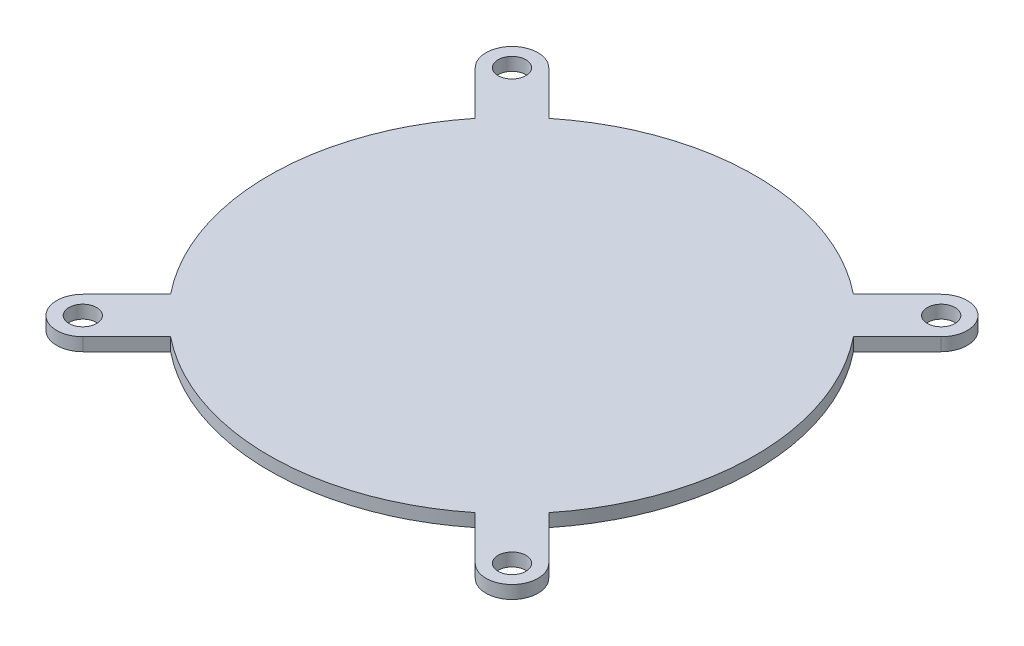
ISO-10303-21;
HEADER;
FILE_DESCRIPTION(('STEP AP214'),'2;1');
FILE_NAME('part.step','',(''),(''),'','','');
FILE_SCHEMA(('AUTOMOTIVE_DESIGN { 1 0 10303 214 1 1 1 1 }'));
ENDSEC;
DATA;
#1=APPLICATION_CONTEXT('core data for automotive mechanical design processes');
#2=APPLICATION_PROTOCOL_DEFINITION('international standard','automotive_design',2000,#1);
#3=PRODUCT_CONTEXT('',#1,'mechanical');
#4=PRODUCT('Part','Part','',(#3));
#5=PRODUCT_RELATED_PRODUCT_CATEGORY('part','',(#4));
#6=PRODUCT_DEFINITION_FORMATION('','',#4);
#7=PRODUCT_DEFINITION_CONTEXT('part definition',#1,'design');
#8=PRODUCT_DEFINITION('design','',#6,#7);
#9=PRODUCT_DEFINITION_SHAPE('','',#8);
#10=(LENGTH_UNIT() NAMED_UNIT(*) SI_UNIT(.MILLI.,.METRE.));
#11=(NAMED_UNIT(*) PLANE_ANGLE_UNIT() SI_UNIT($,.RADIAN.));
#12=(NAMED_UNIT(*) SI_UNIT($,.STERADIAN.) SOLID_ANGLE_UNIT());
#13=UNCERTAINTY_MEASURE_WITH_UNIT(LENGTH_MEASURE(1.E-05),#10,'distance_accuracy_value','');
#14=(GEOMETRIC_REPRESENTATION_CONTEXT(3) GLOBAL_UNCERTAINTY_ASSIGNED_CONTEXT((#13)) GLOBAL_UNIT_ASSIGNED_CONTEXT((#10,
#11,#12)) REPRESENTATION_CONTEXT('',''));
#15=CARTESIAN_POINT('',(0.,0.,0.));
#16=DIRECTION('',(0.,0.,1.));
#17=DIRECTION('',(1.,0.,0.));
#18=AXIS2_PLACEMENT_3D('',#15,#16,#17);
#19=CARTESIAN_POINT('',(0.,-8.,0.));
#20=DIRECTION('',(0.,1.,0.));
#21=DIRECTION('',(0.,0.,1.));
#22=AXIS2_PLACEMENT_3D('',#19,#20,#21);
#23=CYLINDRICAL_SURFACE('',#22,13.8);
#24=CARTESIAN_POINT('',(0.,0.,0.));
#25=DIRECTION('',(0.,1.,0.));
#26=DIRECTION('',(0.,0.,1.));
#27=AXIS2_PLACEMENT_3D('',#24,#25,#26);
#28=CIRCLE('',#27,13.8);
#29=CARTESIAN_POINT('',(0.,0.,13.8));
#30=VERTEX_POINT('',#29);
#31=EDGE_CURVE('E41',#30,#30,#28,.F.);
#32=ORIENTED_EDGE('',*,*,#31,.T.);
#33=EDGE_LOOP('',(#32));
#34=FACE_BOUND('',#33,.T.);
#35=CARTESIAN_POINT('',(0.,-9.,0.));
#36=DIRECTION('',(0.,-1.,0.));
#37=DIRECTION('',(0.,0.,-1.));
#38=AXIS2_PLACEMENT_3D('',#35,#36,#37);
#39=CIRCLE('',#38,13.8);
#40=CARTESIAN_POINT('',(0.,-9.,-13.8));
#41=VERTEX_POINT('',#40);
#42=EDGE_CURVE('E152',#41,#41,#39,.T.);
#43=ORIENTED_EDGE('',*,*,#42,.F.);
#44=EDGE_LOOP('',(#43));
#45=FACE_BOUND('',#44,.T.);
#46=ADVANCED_FACE('F32',(#34,#45),#23,.T.);
#47=CARTESIAN_POINT('',(-21.2132034355964,1.5,21.2132034355964));
#48=DIRECTION('',(0.,1.,0.));
#49=DIRECTION('',(0.,0.,1.));
#50=AXIS2_PLACEMENT_3D('',#47,#48,#49);
#51=PLANE('',#50);
#52=DIRECTION('',(0.707106781186544,0.,-0.707106781186551));
#53=VECTOR('',#52,1.);
#54=CARTESIAN_POINT('',(-19.0918830920368,1.5,23.3345237791561));
#55=LINE('',#54,#53);
#56=CARTESIAN_POINT('',(-22.6274169979695,1.5,26.8700576850888));
#57=VERTEX_POINT('',#56);
#58=CARTESIAN_POINT('',(-17.5636993414699,1.5,21.8063400285892));
#59=VERTEX_POINT('',#58);
#60=EDGE_CURVE('E196',#57,#59,#55,.T.);
#61=ORIENTED_EDGE('',*,*,#60,.T.);
#62=CARTESIAN_POINT('',(0.,1.5,0.));
#63=DIRECTION('',(0.,1.,0.));
#64=DIRECTION('',(0.,0.,1.));
#65=AXIS2_PLACEMENT_3D('',#62,#63,#64);
#66=CIRCLE('',#65,28.);
#67=CARTESIAN_POINT('',(17.5636993414699,1.5,21.8063400285892));
#68=VERTEX_POINT('',#67);
#69=EDGE_CURVE('E148',#59,#68,#66,.T.);
#70=ORIENTED_EDGE('',*,*,#69,.T.);
#71=DIRECTION('',(0.70710678118655,0.,0.707106781186545));
#72=VECTOR('',#71,1.);
#73=CARTESIAN_POINT('',(19.0918830920368,1.5,23.3345237791561));
#74=LINE('',#73,#72);
#75=CARTESIAN_POINT('',(22.6274169979695,1.5,26.8700576850888));
#76=VERTEX_POINT('',#75);
#77=EDGE_CURVE('E274',#68,#76,#74,.T.);
#78=ORIENTED_EDGE('',*,*,#77,.T.);
#79=CARTESIAN_POINT('',(24.7487373415292,1.5,24.7487373415292));
#80=DIRECTION('',(0.,1.,0.));
#81=DIRECTION('',(0.,0.,1.));
#82=AXIS2_PLACEMENT_3D('',#79,#80,#81);
#83=CIRCLE('',#82,3.);
#84=CARTESIAN_POINT('',(26.8700576850888,1.5,22.6274169979695));
#85=VERTEX_POINT('',#84);
#86=EDGE_CURVE('E230',#76,#85,#83,.T.);
#87=ORIENTED_EDGE('',*,*,#86,.T.);
#88=DIRECTION('',(-0.707106781186548,0.,-0.707106781186547));
#89=VECTOR('',#88,1.);
#90=CARTESIAN_POINT('',(23.3345237791561,1.5,19.0918830920368));
#91=LINE('',#90,#89);
#92=CARTESIAN_POINT('',(21.8063400285892,1.5,17.5636993414699));
#93=VERTEX_POINT('',#92);
#94=EDGE_CURVE('E276',#85,#93,#91,.T.);
#95=ORIENTED_EDGE('',*,*,#94,.T.);
#96=CARTESIAN_POINT('',(21.8063400285892,1.5,-17.5636993414699));
#97=VERTEX_POINT('',#96);
#98=EDGE_CURVE('E166',#93,#97,#66,.T.);
#99=ORIENTED_EDGE('',*,*,#98,.T.);
#100=DIRECTION('',(0.707106781186547,0.,-0.707106781186548));
#101=VECTOR('',#100,1.);
#102=CARTESIAN_POINT('',(23.3345237791561,1.5,-19.0918830920368));
#103=LINE('',#102,#101);
#104=CARTESIAN_POINT('',(26.8700576850888,1.5,-22.6274169979695));
#105=VERTEX_POINT('',#104);
#106=EDGE_CURVE('E279',#97,#105,#103,.T.);
#107=ORIENTED_EDGE('',*,*,#106,.T.);
#108=CARTESIAN_POINT('',(24.7487373415292,1.5,-24.7487373415292));
#109=DIRECTION('',(0.,1.,0.));
#110=DIRECTION('',(0.,0.,-1.));
#111=AXIS2_PLACEMENT_3D('',#108,#109,#110);
#112=CIRCLE('',#111,3.);
#113=CARTESIAN_POINT('',(22.6274169979695,1.5,-26.8700576850888));
#114=VERTEX_POINT('',#113);
#115=EDGE_CURVE('E248',#105,#114,#112,.T.);
#116=ORIENTED_EDGE('',*,*,#115,.T.);
#117=DIRECTION('',(-0.707106781186544,0.,0.707106781186551));
#118=VECTOR('',#117,1.);
#119=CARTESIAN_POINT('',(19.0918830920368,1.5,-23.3345237791561));
#120=LINE('',#119,#118);
#121=CARTESIAN_POINT('',(17.5636993414699,1.5,-21.8063400285892));
#122=VERTEX_POINT('',#121);
#123=EDGE_CURVE('E281',#114,#122,#120,.T.);
#124=ORIENTED_EDGE('',*,*,#123,.T.);
#125=CARTESIAN_POINT('',(-17.5636993414699,1.5,-21.8063400285892));
#126=VERTEX_POINT('',#125);
#127=EDGE_CURVE('E314',#122,#126,#66,.T.);
#128=ORIENTED_EDGE('',*,*,#127,.T.);
#129=DIRECTION('',(-0.707106781186551,0.,-0.707106781186544));
#130=VECTOR('',#129,1.);
#131=CARTESIAN_POINT('',(-19.0918830920368,1.5,-23.3345237791561));
#132=LINE('',#131,#130);
#133=CARTESIAN_POINT('',(-22.6274169979695,1.5,-26.8700576850888));
#134=VERTEX_POINT('',#133);
#135=EDGE_CURVE('E284',#126,#134,#132,.T.);
#136=ORIENTED_EDGE('',*,*,#135,.T.);
#137=CARTESIAN_POINT('',(-24.7487373415292,1.5,-24.7487373415292));
#138=DIRECTION('',(0.,1.,0.));
#139=DIRECTION('',(0.,0.,1.));
#140=AXIS2_PLACEMENT_3D('',#137,#138,#139);
#141=CIRCLE('',#140,3.);
#142=CARTESIAN_POINT('',(-26.8700576850888,1.5,-22.6274169979695));
#143=VERTEX_POINT('',#142);
#144=EDGE_CURVE('E264',#134,#143,#141,.T.);
#145=ORIENTED_EDGE('',*,*,#144,.T.);
#146=DIRECTION('',(0.707106781186552,0.,0.707106781186543));
#147=VECTOR('',#146,1.);
#148=CARTESIAN_POINT('',(-23.3345237791561,1.5,-19.0918830920368));
#149=LINE('',#148,#147);
#150=CARTESIAN_POINT('',(-21.8063400285892,1.5,-17.5636993414699));
#151=VERTEX_POINT('',#150);
#152=EDGE_CURVE('E285',#143,#151,#149,.T.);
#153=ORIENTED_EDGE('',*,*,#152,.T.);
#154=CARTESIAN_POINT('',(-21.8063400285892,1.5,17.5636993414699));
#155=VERTEX_POINT('',#154);
#156=EDGE_CURVE('E293',#151,#155,#66,.T.);
#157=ORIENTED_EDGE('',*,*,#156,.T.);
#158=DIRECTION('',(-0.707106781186543,0.,0.707106781186552));
#159=VECTOR('',#158,1.);
#160=CARTESIAN_POINT('',(-23.3345237791561,1.5,19.0918830920368));
#161=LINE('',#160,#159);
#162=CARTESIAN_POINT('',(-26.8700576850888,1.5,22.6274169979695));
#163=VERTEX_POINT('',#162);
#164=EDGE_CURVE('E180',#155,#163,#161,.T.);
#165=ORIENTED_EDGE('',*,*,#164,.T.);
#166=CARTESIAN_POINT('',(-24.7487373415292,1.5,24.7487373415292));
#167=DIRECTION('',(0.,1.,0.));
#168=DIRECTION('',(0.,0.,-1.));
#169=AXIS2_PLACEMENT_3D('',#166,#167,#168);
#170=CIRCLE('',#169,3.);
#171=EDGE_CURVE('E204',#163,#57,#170,.T.);
#172=ORIENTED_EDGE('',*,*,#171,.T.);
#173=EDGE_LOOP('',(#61,#70,#78,#87,#95,#99,#107,#116,#124,#128,#136,#145,#153,#157,#165,#172));
#174=FACE_BOUND('',#173,.T.);
#175=CARTESIAN_POINT('',(-24.7487373415292,1.5,24.7487373415292));
#176=DIRECTION('',(0.,1.,0.));
#177=DIRECTION('',(0.,0.,-1.));
#178=AXIS2_PLACEMENT_3D('',#175,#176,#177);
#179=CIRCLE('',#178,1.6);
#180=CARTESIAN_POINT('',(-24.7487373415292,1.5,23.1487373415292));
#181=VERTEX_POINT('',#180);
#182=EDGE_CURVE('E200',#181,#181,#179,.T.);
#183=ORIENTED_EDGE('',*,*,#182,.F.);
#184=EDGE_LOOP('',(#183));
#185=FACE_BOUND('',#184,.T.);
#186=CARTESIAN_POINT('',(-24.7487373415292,1.5,-24.7487373415292));
#187=DIRECTION('',(0.,1.,0.));
#188=DIRECTION('',(0.,0.,1.));
#189=AXIS2_PLACEMENT_3D('',#186,#187,#188);
#190=CIRCLE('',#189,1.6);
#191=CARTESIAN_POINT('',(-24.7487373415292,1.5,-23.1487373415292));
#192=VERTEX_POINT('',#191);
#193=EDGE_CURVE('E258',#192,#192,#190,.T.);
#194=ORIENTED_EDGE('',*,*,#193,.F.);
#195=EDGE_LOOP('',(#194));
#196=FACE_BOUND('',#195,.T.);
#197=CARTESIAN_POINT('',(24.7487373415292,1.5,-24.7487373415292));
#198=DIRECTION('',(0.,1.,0.));
#199=DIRECTION('',(0.,0.,-1.));
#200=AXIS2_PLACEMENT_3D('',#197,#198,#199);
#201=CIRCLE('',#200,1.6);
#202=CARTESIAN_POINT('',(24.7487373415292,1.5,-26.3487373415292));
#203=VERTEX_POINT('',#202);
#204=EDGE_CURVE('E240',#203,#203,#201,.T.);
#205=ORIENTED_EDGE('',*,*,#204,.F.);
#206=EDGE_LOOP('',(#205));
#207=FACE_BOUND('',#206,.T.);
#208=CARTESIAN_POINT('',(24.7487373415292,1.5,24.7487373415292));
#209=DIRECTION('',(0.,1.,0.));
#210=DIRECTION('',(0.,0.,1.));
#211=AXIS2_PLACEMENT_3D('',#208,#209,#210);
#212=CIRCLE('',#211,1.6);
#213=CARTESIAN_POINT('',(24.7487373415292,1.5,26.3487373415292));
#214=VERTEX_POINT('',#213);
#215=EDGE_CURVE('E223',#214,#214,#212,.T.);
#216=ORIENTED_EDGE('',*,*,#215,.F.);
#217=EDGE_LOOP('',(#216));
#218=FACE_BOUND('',#217,.T.);
#219=ADVANCED_FACE('F290',(#174,#185,#196,#207,#218),#51,.T.);
#220=CARTESIAN_POINT('',(-21.2132034355964,0.,21.2132034355964));
#221=DIRECTION('',(0.,1.,0.));
#222=DIRECTION('',(0.,0.,1.));
#223=AXIS2_PLACEMENT_3D('',#220,#221,#222);
#224=PLANE('',#223);
#225=DIRECTION('',(-0.707106781186543,0.,0.707106781186552));
#226=VECTOR('',#225,1.);
#227=CARTESIAN_POINT('',(-23.3345237791561,0.,19.0918830920368));
#228=LINE('',#227,#226);
#229=CARTESIAN_POINT('',(-21.8063400285892,0.,17.5636993414699));
#230=VERTEX_POINT('',#229);
#231=CARTESIAN_POINT('',(-26.8700576850888,0.,22.6274169979695));
#232=VERTEX_POINT('',#231);
#233=EDGE_CURVE('E194',#230,#232,#228,.T.);
#234=ORIENTED_EDGE('',*,*,#233,.F.);
#235=CARTESIAN_POINT('',(0.,0.,0.));
#236=DIRECTION('',(0.,1.,0.));
#237=DIRECTION('',(0.,0.,1.));
#238=AXIS2_PLACEMENT_3D('',#235,#236,#237);
#239=CIRCLE('',#238,28.);
#240=CARTESIAN_POINT('',(-21.8063400285892,0.,-17.5636993414699));
#241=VERTEX_POINT('',#240);
#242=EDGE_CURVE('E168',#230,#241,#239,.F.);
#243=ORIENTED_EDGE('',*,*,#242,.T.);
#244=DIRECTION('',(0.707106781186552,0.,0.707106781186543));
#245=VECTOR('',#244,1.);
#246=CARTESIAN_POINT('',(-23.3345237791561,0.,-19.0918830920368));
#247=LINE('',#246,#245);
#248=CARTESIAN_POINT('',(-26.8700576850888,0.,-22.6274169979695));
#249=VERTEX_POINT('',#248);
#250=EDGE_CURVE('E191',#249,#241,#247,.T.);
#251=ORIENTED_EDGE('',*,*,#250,.F.);
#252=CARTESIAN_POINT('',(-24.7487373415292,0.,-24.7487373415292));
#253=DIRECTION('',(0.,1.,0.));
#254=DIRECTION('',(0.,0.,1.));
#255=AXIS2_PLACEMENT_3D('',#252,#253,#254);
#256=CIRCLE('',#255,3.);
#257=CARTESIAN_POINT('',(-22.6274169979695,0.,-26.8700576850888));
#258=VERTEX_POINT('',#257);
#259=EDGE_CURVE('E259',#249,#258,#256,.F.);
#260=ORIENTED_EDGE('',*,*,#259,.T.);
#261=DIRECTION('',(-0.707106781186551,0.,-0.707106781186544));
#262=VECTOR('',#261,1.);
#263=CARTESIAN_POINT('',(-19.0918830920368,0.,-23.3345237791561));
#264=LINE('',#263,#262);
#265=CARTESIAN_POINT('',(-17.5636993414699,0.,-21.8063400285892));
#266=VERTEX_POINT('',#265);
#267=EDGE_CURVE('E47',#266,#258,#264,.T.);
#268=ORIENTED_EDGE('',*,*,#267,.F.);
#269=CARTESIAN_POINT('',(17.5636993414699,0.,-21.8063400285892));
#270=VERTEX_POINT('',#269);
#271=EDGE_CURVE('E303',#266,#270,#239,.F.);
#272=ORIENTED_EDGE('',*,*,#271,.T.);
#273=DIRECTION('',(-0.707106781186544,0.,0.707106781186551));
#274=VECTOR('',#273,1.);
#275=CARTESIAN_POINT('',(19.0918830920368,0.,-23.3345237791561));
#276=LINE('',#275,#274);
#277=CARTESIAN_POINT('',(22.6274169979695,0.,-26.8700576850888));
#278=VERTEX_POINT('',#277);
#279=EDGE_CURVE('E187',#278,#270,#276,.T.);
#280=ORIENTED_EDGE('',*,*,#279,.F.);
#281=CARTESIAN_POINT('',(24.7487373415292,0.,-24.7487373415292));
#282=DIRECTION('',(0.,1.,0.));
#283=DIRECTION('',(0.,0.,1.));
#284=AXIS2_PLACEMENT_3D('',#281,#282,#283);
#285=CIRCLE('',#284,3.);
#286=CARTESIAN_POINT('',(26.8700576850888,0.,-22.6274169979695));
#287=VERTEX_POINT('',#286);
#288=EDGE_CURVE('E241',#278,#287,#285,.F.);
#289=ORIENTED_EDGE('',*,*,#288,.T.);
#290=DIRECTION('',(0.707106781186547,0.,-0.707106781186548));
#291=VECTOR('',#290,1.);
#292=CARTESIAN_POINT('',(23.3345237791561,0.,-19.0918830920368));
#293=LINE('',#292,#291);
#294=CARTESIAN_POINT('',(21.8063400285892,0.,-17.5636993414699));
#295=VERTEX_POINT('',#294);
#296=EDGE_CURVE('E185',#295,#287,#293,.T.);
#297=ORIENTED_EDGE('',*,*,#296,.F.);
#298=CARTESIAN_POINT('',(21.8063400285892,0.,17.5636993414699));
#299=VERTEX_POINT('',#298);
#300=EDGE_CURVE('E165',#295,#299,#239,.F.);
#301=ORIENTED_EDGE('',*,*,#300,.T.);
#302=DIRECTION('',(-0.707106781186548,0.,-0.707106781186547));
#303=VECTOR('',#302,1.);
#304=CARTESIAN_POINT('',(23.3345237791561,0.,19.0918830920368));
#305=LINE('',#304,#303);
#306=CARTESIAN_POINT('',(26.8700576850888,0.,22.6274169979695));
#307=VERTEX_POINT('',#306);
#308=EDGE_CURVE('E174',#307,#299,#305,.T.);
#309=ORIENTED_EDGE('',*,*,#308,.F.);
#310=CARTESIAN_POINT('',(24.7487373415292,0.,24.7487373415292));
#311=DIRECTION('',(0.,1.,0.));
#312=DIRECTION('',(0.,0.,1.));
#313=AXIS2_PLACEMENT_3D('',#310,#311,#312);
#314=CIRCLE('',#313,3.);
#315=CARTESIAN_POINT('',(22.6274169979695,0.,26.8700576850888));
#316=VERTEX_POINT('',#315);
#317=EDGE_CURVE('E224',#307,#316,#314,.F.);
#318=ORIENTED_EDGE('',*,*,#317,.T.);
#319=DIRECTION('',(0.70710678118655,0.,0.707106781186545));
#320=VECTOR('',#319,1.);
#321=CARTESIAN_POINT('',(19.0918830920368,0.,23.3345237791561));
#322=LINE('',#321,#320);
#323=CARTESIAN_POINT('',(17.5636993414699,0.,21.8063400285892));
#324=VERTEX_POINT('',#323);
#325=EDGE_CURVE('E164',#324,#316,#322,.T.);
#326=ORIENTED_EDGE('',*,*,#325,.F.);
#327=CARTESIAN_POINT('',(-17.5636993414699,0.,21.8063400285892));
#328=VERTEX_POINT('',#327);
#329=EDGE_CURVE('E145',#324,#328,#239,.F.);
#330=ORIENTED_EDGE('',*,*,#329,.T.);
#331=DIRECTION('',(0.707106781186544,0.,-0.707106781186551));
#332=VECTOR('',#331,1.);
#333=CARTESIAN_POINT('',(-19.0918830920368,0.,23.3345237791561));
#334=LINE('',#333,#332);
#335=CARTESIAN_POINT('',(-22.6274169979695,0.,26.8700576850888));
#336=VERTEX_POINT('',#335);
#337=EDGE_CURVE('E161',#336,#328,#334,.T.);
#338=ORIENTED_EDGE('',*,*,#337,.F.);
#339=CARTESIAN_POINT('',(-24.7487373415292,0.,24.7487373415292));
#340=DIRECTION('',(0.,1.,0.));
#341=DIRECTION('',(0.,0.,1.));
#342=AXIS2_PLACEMENT_3D('',#339,#340,#341);
#343=CIRCLE('',#342,3.);
#344=EDGE_CURVE('E212',#336,#232,#343,.F.);
#345=ORIENTED_EDGE('',*,*,#344,.T.);
#346=EDGE_LOOP('',(#234,#243,#251,#260,#268,#272,#280,#289,#297,#301,#309,#318,#326,#330,#338,#345));
#347=FACE_BOUND('',#346,.T.);
#348=CARTESIAN_POINT('',(-24.7487373415292,0.,24.7487373415292));
#349=DIRECTION('',(0.,1.,0.));
#350=DIRECTION('',(0.,0.,1.));
#351=AXIS2_PLACEMENT_3D('',#348,#349,#350);
#352=CIRCLE('',#351,1.6);
#353=CARTESIAN_POINT('',(-24.7487373415292,0.,26.3487373415292));
#354=VERTEX_POINT('',#353);
#355=EDGE_CURVE('E213',#354,#354,#352,.F.);
#356=ORIENTED_EDGE('',*,*,#355,.F.);
#357=EDGE_LOOP('',(#356));
#358=FACE_BOUND('',#357,.T.);
#359=ORIENTED_EDGE('',*,*,#31,.F.);
#360=EDGE_LOOP('',(#359));
#361=FACE_BOUND('',#360,.T.);
#362=CARTESIAN_POINT('',(-24.7487373415292,0.,-24.7487373415292));
#363=DIRECTION('',(0.,1.,0.));
#364=DIRECTION('',(0.,0.,1.));
#365=AXIS2_PLACEMENT_3D('',#362,#363,#364);
#366=CIRCLE('',#365,1.6);
#367=CARTESIAN_POINT('',(-24.7487373415292,0.,-23.1487373415292));
#368=VERTEX_POINT('',#367);
#369=EDGE_CURVE('E177',#368,#368,#366,.F.);
#370=ORIENTED_EDGE('',*,*,#369,.F.);
#371=EDGE_LOOP('',(#370));
#372=FACE_BOUND('',#371,.T.);
#373=CARTESIAN_POINT('',(24.7487373415292,0.,-24.7487373415292));
#374=DIRECTION('',(0.,1.,0.));
#375=DIRECTION('',(0.,0.,1.));
#376=AXIS2_PLACEMENT_3D('',#373,#374,#375);
#377=CIRCLE('',#376,1.6);
#378=CARTESIAN_POINT('',(24.7487373415292,0.,-23.1487373415292));
#379=VERTEX_POINT('',#378);
#380=EDGE_CURVE('E244',#379,#379,#377,.F.);
#381=ORIENTED_EDGE('',*,*,#380,.F.);
#382=EDGE_LOOP('',(#381));
#383=FACE_BOUND('',#382,.T.);
#384=CARTESIAN_POINT('',(24.7487373415292,0.,24.7487373415292));
#385=DIRECTION('',(0.,1.,0.));
#386=DIRECTION('',(0.,0.,1.));
#387=AXIS2_PLACEMENT_3D('',#384,#385,#386);
#388=CIRCLE('',#387,1.6);
#389=CARTESIAN_POINT('',(24.7487373415292,0.,26.3487373415292));
#390=VERTEX_POINT('',#389);
#391=EDGE_CURVE('E226',#390,#390,#388,.F.);
#392=ORIENTED_EDGE('',*,*,#391,.F.);
#393=EDGE_LOOP('',(#392));
#394=FACE_BOUND('',#393,.T.);
#395=ADVANCED_FACE('F158',(#347,#358,#361,#372,#383,#394),#224,.F.);
#396=CARTESIAN_POINT('',(-19.0918830920368,1.5,23.3345237791561));
#397=DIRECTION('',(-0.707106781186551,0.,-0.707106781186544));
#398=DIRECTION('',(-0.707106781186544,0.,0.707106781186551));
#399=AXIS2_PLACEMENT_3D('',#396,#397,#398);
#400=PLANE('',#399);
#401=ORIENTED_EDGE('',*,*,#337,.T.);
#402=DIRECTION('',(0.,1.,0.));
#403=VECTOR('',#402,1.);
#404=CARTESIAN_POINT('',(-17.5636993414699,-79.1959594928933,21.8063400285892));
#405=LINE('',#404,#403);
#406=EDGE_CURVE('E142',#328,#59,#405,.T.);
#407=ORIENTED_EDGE('',*,*,#406,.T.);
#408=ORIENTED_EDGE('',*,*,#60,.F.);
#409=DIRECTION('',(0.,1.,0.));
#410=VECTOR('',#409,1.);
#411=CARTESIAN_POINT('',(-22.6274169979695,-17.0790056568314,26.8700576850888));
#412=LINE('',#411,#410);
#413=EDGE_CURVE('E171',#336,#57,#412,.T.);
#414=ORIENTED_EDGE('',*,*,#413,.F.);
#415=EDGE_LOOP('',(#401,#407,#408,#414));
#416=FACE_BOUND('',#415,.T.);
#417=ADVANCED_FACE('F34',(#416),#400,.F.);
#418=CARTESIAN_POINT('',(19.0918830920368,1.5,23.3345237791561));
#419=DIRECTION('',(0.707106781186545,0.,-0.70710678118655));
#420=DIRECTION('',(-0.70710678118655,0.,-0.707106781186545));
#421=AXIS2_PLACEMENT_3D('',#418,#419,#420);
#422=PLANE('',#421);
#423=ORIENTED_EDGE('',*,*,#77,.F.);
#424=DIRECTION('',(0.,1.,0.));
#425=VECTOR('',#424,1.);
#426=CARTESIAN_POINT('',(17.5636993414699,-79.1959594928933,21.8063400285892));
#427=LINE('',#426,#425);
#428=EDGE_CURVE('E153',#68,#324,#427,.F.);
#429=ORIENTED_EDGE('',*,*,#428,.T.);
#430=ORIENTED_EDGE('',*,*,#325,.T.);
#431=DIRECTION('',(0.,1.,0.));
#432=VECTOR('',#431,1.);
#433=CARTESIAN_POINT('',(22.6274169979695,-17.0790056568314,26.8700576850888));
#434=LINE('',#433,#432);
#435=EDGE_CURVE('E227',#316,#76,#434,.T.);
#436=ORIENTED_EDGE('',*,*,#435,.T.);
#437=EDGE_LOOP('',(#423,#429,#430,#436));
#438=FACE_BOUND('',#437,.T.);
#439=ADVANCED_FACE('F420',(#438),#422,.F.);
#440=CARTESIAN_POINT('',(23.3345237791561,1.5,19.0918830920368));
#441=DIRECTION('',(-0.707106781186547,0.,0.707106781186548));
#442=DIRECTION('',(0.707106781186548,0.,0.707106781186547));
#443=AXIS2_PLACEMENT_3D('',#440,#441,#442);
#444=PLANE('',#443);
#445=ORIENTED_EDGE('',*,*,#308,.T.);
#446=DIRECTION('',(0.,1.,0.));
#447=VECTOR('',#446,1.);
#448=CARTESIAN_POINT('',(21.8063400285892,-79.1959594928933,17.5636993414699));
#449=LINE('',#448,#447);
#450=EDGE_CURVE('E415',#299,#93,#449,.T.);
#451=ORIENTED_EDGE('',*,*,#450,.T.);
#452=ORIENTED_EDGE('',*,*,#94,.F.);
#453=DIRECTION('',(0.,1.,0.));
#454=VECTOR('',#453,1.);
#455=CARTESIAN_POINT('',(26.8700576850888,-17.0790056568314,22.6274169979695));
#456=LINE('',#455,#454);
#457=EDGE_CURVE('E233',#307,#85,#456,.T.);
#458=ORIENTED_EDGE('',*,*,#457,.F.);
#459=EDGE_LOOP('',(#445,#451,#452,#458));
#460=FACE_BOUND('',#459,.T.);
#461=ADVANCED_FACE('F414',(#460),#444,.F.);
#462=CARTESIAN_POINT('',(23.3345237791561,1.5,-19.0918830920368));
#463=DIRECTION('',(-0.707106781186548,0.,-0.707106781186547));
#464=DIRECTION('',(-0.707106781186547,0.,0.707106781186548));
#465=AXIS2_PLACEMENT_3D('',#462,#463,#464);
#466=PLANE('',#465);
#467=ORIENTED_EDGE('',*,*,#106,.F.);
#468=DIRECTION('',(0.,1.,0.));
#469=VECTOR('',#468,1.);
#470=CARTESIAN_POINT('',(21.8063400285892,-79.1959594928933,-17.5636993414699));
#471=LINE('',#470,#469);
#472=EDGE_CURVE('E407',#97,#295,#471,.F.);
#473=ORIENTED_EDGE('',*,*,#472,.T.);
#474=ORIENTED_EDGE('',*,*,#296,.T.);
#475=DIRECTION('',(0.,1.,0.));
#476=VECTOR('',#475,1.);
#477=CARTESIAN_POINT('',(26.8700576850888,-17.0790056568314,-22.6274169979695));
#478=LINE('',#477,#476);
#479=EDGE_CURVE('E245',#287,#105,#478,.T.);
#480=ORIENTED_EDGE('',*,*,#479,.T.);
#481=EDGE_LOOP('',(#467,#473,#474,#480));
#482=FACE_BOUND('',#481,.T.);
#483=ADVANCED_FACE('F324',(#482),#466,.F.);
#484=CARTESIAN_POINT('',(19.0918830920368,1.5,-23.3345237791561));
#485=DIRECTION('',(0.707106781186551,0.,0.707106781186544));
#486=DIRECTION('',(0.707106781186544,0.,-0.707106781186551));
#487=AXIS2_PLACEMENT_3D('',#484,#485,#486);
#488=PLANE('',#487);
#489=ORIENTED_EDGE('',*,*,#279,.T.);
#490=DIRECTION('',(0.,1.,0.));
#491=VECTOR('',#490,1.);
#492=CARTESIAN_POINT('',(17.5636993414699,-79.1959594928933,-21.8063400285892));
#493=LINE('',#492,#491);
#494=EDGE_CURVE('E402',#270,#122,#493,.T.);
#495=ORIENTED_EDGE('',*,*,#494,.T.);
#496=ORIENTED_EDGE('',*,*,#123,.F.);
#497=DIRECTION('',(0.,1.,0.));
#498=VECTOR('',#497,1.);
#499=CARTESIAN_POINT('',(22.6274169979695,-17.0790056568314,-26.8700576850888));
#500=LINE('',#499,#498);
#501=EDGE_CURVE('E251',#278,#114,#500,.T.);
#502=ORIENTED_EDGE('',*,*,#501,.F.);
#503=EDGE_LOOP('',(#489,#495,#496,#502));
#504=FACE_BOUND('',#503,.T.);
#505=ADVANCED_FACE('F317',(#504),#488,.F.);
#506=CARTESIAN_POINT('',(-19.0918830920368,1.5,-23.3345237791561));
#507=DIRECTION('',(-0.707106781186544,0.,0.707106781186551));
#508=DIRECTION('',(0.707106781186551,0.,0.707106781186544));
#509=AXIS2_PLACEMENT_3D('',#506,#507,#508);
#510=PLANE('',#509);
#511=ORIENTED_EDGE('',*,*,#135,.F.);
#512=DIRECTION('',(0.,1.,0.));
#513=VECTOR('',#512,1.);
#514=CARTESIAN_POINT('',(-17.5636993414699,-79.1959594928933,-21.8063400285892));
#515=LINE('',#514,#513);
#516=EDGE_CURVE('E425',#126,#266,#515,.F.);
#517=ORIENTED_EDGE('',*,*,#516,.T.);
#518=ORIENTED_EDGE('',*,*,#267,.T.);
#519=DIRECTION('',(0.,1.,0.));
#520=VECTOR('',#519,1.);
#521=CARTESIAN_POINT('',(-22.6274169979695,-17.0790056568314,-26.8700576850888));
#522=LINE('',#521,#520);
#523=EDGE_CURVE('E261',#258,#134,#522,.T.);
#524=ORIENTED_EDGE('',*,*,#523,.T.);
#525=EDGE_LOOP('',(#511,#517,#518,#524));
#526=FACE_BOUND('',#525,.T.);
#527=ADVANCED_FACE('F315',(#526),#510,.F.);
#528=CARTESIAN_POINT('',(-23.3345237791561,1.5,-19.0918830920368));
#529=DIRECTION('',(0.707106781186543,0.,-0.707106781186552));
#530=DIRECTION('',(-0.707106781186552,0.,-0.707106781186543));
#531=AXIS2_PLACEMENT_3D('',#528,#529,#530);
#532=PLANE('',#531);
#533=ORIENTED_EDGE('',*,*,#250,.T.);
#534=DIRECTION('',(0.,1.,0.));
#535=VECTOR('',#534,1.);
#536=CARTESIAN_POINT('',(-21.8063400285892,-79.1959594928933,-17.5636993414699));
#537=LINE('',#536,#535);
#538=EDGE_CURVE('E302',#241,#151,#537,.T.);
#539=ORIENTED_EDGE('',*,*,#538,.T.);
#540=ORIENTED_EDGE('',*,*,#152,.F.);
#541=DIRECTION('',(0.,1.,0.));
#542=VECTOR('',#541,1.);
#543=CARTESIAN_POINT('',(-26.8700576850888,-17.0790056568314,-22.6274169979695));
#544=LINE('',#543,#542);
#545=EDGE_CURVE('E267',#249,#143,#544,.T.);
#546=ORIENTED_EDGE('',*,*,#545,.F.);
#547=EDGE_LOOP('',(#533,#539,#540,#546));
#548=FACE_BOUND('',#547,.T.);
#549=ADVANCED_FACE('F307',(#548),#532,.F.);
#550=CARTESIAN_POINT('',(-23.3345237791561,1.5,19.0918830920368));
#551=DIRECTION('',(0.707106781186552,0.,0.707106781186543));
#552=DIRECTION('',(0.707106781186543,0.,-0.707106781186552));
#553=AXIS2_PLACEMENT_3D('',#550,#551,#552);
#554=PLANE('',#553);
#555=ORIENTED_EDGE('',*,*,#164,.F.);
#556=DIRECTION('',(0.,1.,0.));
#557=VECTOR('',#556,1.);
#558=CARTESIAN_POINT('',(-21.8063400285892,-79.1959594928933,17.5636993414699));
#559=LINE('',#558,#557);
#560=EDGE_CURVE('E11',#155,#230,#559,.F.);
#561=ORIENTED_EDGE('',*,*,#560,.T.);
#562=ORIENTED_EDGE('',*,*,#233,.T.);
#563=DIRECTION('',(0.,1.,0.));
#564=VECTOR('',#563,1.);
#565=CARTESIAN_POINT('',(-26.8700576850888,-17.0790056568314,22.6274169979695));
#566=LINE('',#565,#564);
#567=EDGE_CURVE('E214',#232,#163,#566,.T.);
#568=ORIENTED_EDGE('',*,*,#567,.T.);
#569=EDGE_LOOP('',(#555,#561,#562,#568));
#570=FACE_BOUND('',#569,.T.);
#571=ADVANCED_FACE('F296',(#570),#554,.F.);
#572=CARTESIAN_POINT('',(-24.7487373415292,-17.0790056568314,-24.7487373415292));
#573=DIRECTION('',(0.,1.,0.));
#574=DIRECTION('',(0.,0.,1.));
#575=AXIS2_PLACEMENT_3D('',#572,#573,#574);
#576=CYLINDRICAL_SURFACE('',#575,3.);
#577=ORIENTED_EDGE('',*,*,#259,.F.);
#578=ORIENTED_EDGE('',*,*,#545,.T.);
#579=ORIENTED_EDGE('',*,*,#144,.F.);
#580=ORIENTED_EDGE('',*,*,#523,.F.);
#581=EDGE_LOOP('',(#577,#578,#579,#580));
#582=FACE_BOUND('',#581,.T.);
#583=ADVANCED_FACE('F310',(#582),#576,.T.);
#584=CARTESIAN_POINT('',(-24.7487373415292,-17.0790056568314,-24.7487373415292));
#585=DIRECTION('',(0.,1.,0.));
#586=DIRECTION('',(0.,0.,1.));
#587=AXIS2_PLACEMENT_3D('',#584,#585,#586);
#588=CYLINDRICAL_SURFACE('',#587,1.6);
#589=ORIENTED_EDGE('',*,*,#369,.T.);
#590=EDGE_LOOP('',(#589));
#591=FACE_BOUND('',#590,.T.);
#592=ORIENTED_EDGE('',*,*,#193,.T.);
#593=EDGE_LOOP('',(#592));
#594=FACE_BOUND('',#593,.T.);
#595=ADVANCED_FACE('F345',(#591,#594),#588,.F.);
#596=CARTESIAN_POINT('',(24.7487373415292,-17.0790056568314,-24.7487373415292));
#597=DIRECTION('',(0.,1.,0.));
#598=DIRECTION('',(0.,0.,1.));
#599=AXIS2_PLACEMENT_3D('',#596,#597,#598);
#600=CYLINDRICAL_SURFACE('',#599,3.);
#601=ORIENTED_EDGE('',*,*,#288,.F.);
#602=ORIENTED_EDGE('',*,*,#501,.T.);
#603=ORIENTED_EDGE('',*,*,#115,.F.);
#604=ORIENTED_EDGE('',*,*,#479,.F.);
#605=EDGE_LOOP('',(#601,#602,#603,#604));
#606=FACE_BOUND('',#605,.T.);
#607=ADVANCED_FACE('F350',(#606),#600,.T.);
#608=CARTESIAN_POINT('',(24.7487373415292,-17.0790056568314,-24.7487373415292));
#609=DIRECTION('',(0.,1.,0.));
#610=DIRECTION('',(0.,0.,1.));
#611=AXIS2_PLACEMENT_3D('',#608,#609,#610);
#612=CYLINDRICAL_SURFACE('',#611,1.6);
#613=ORIENTED_EDGE('',*,*,#380,.T.);
#614=EDGE_LOOP('',(#613));
#615=FACE_BOUND('',#614,.T.);
#616=ORIENTED_EDGE('',*,*,#204,.T.);
#617=EDGE_LOOP('',(#616));
#618=FACE_BOUND('',#617,.T.);
#619=ADVANCED_FACE('F388',(#615,#618),#612,.F.);
#620=CARTESIAN_POINT('',(24.7487373415292,-17.0790056568314,24.7487373415292));
#621=DIRECTION('',(0.,1.,0.));
#622=DIRECTION('',(0.,0.,1.));
#623=AXIS2_PLACEMENT_3D('',#620,#621,#622);
#624=CYLINDRICAL_SURFACE('',#623,3.);
#625=ORIENTED_EDGE('',*,*,#317,.F.);
#626=ORIENTED_EDGE('',*,*,#457,.T.);
#627=ORIENTED_EDGE('',*,*,#86,.F.);
#628=ORIENTED_EDGE('',*,*,#435,.F.);
#629=EDGE_LOOP('',(#625,#626,#627,#628));
#630=FACE_BOUND('',#629,.T.);
#631=ADVANCED_FACE('F384',(#630),#624,.T.);
#632=CARTESIAN_POINT('',(24.7487373415292,-17.0790056568314,24.7487373415292));
#633=DIRECTION('',(0.,1.,0.));
#634=DIRECTION('',(0.,0.,1.));
#635=AXIS2_PLACEMENT_3D('',#632,#633,#634);
#636=CYLINDRICAL_SURFACE('',#635,1.6);
#637=ORIENTED_EDGE('',*,*,#391,.T.);
#638=EDGE_LOOP('',(#637));
#639=FACE_BOUND('',#638,.T.);
#640=ORIENTED_EDGE('',*,*,#215,.T.);
#641=EDGE_LOOP('',(#640));
#642=FACE_BOUND('',#641,.T.);
#643=ADVANCED_FACE('F381',(#639,#642),#636,.F.);
#644=CARTESIAN_POINT('',(-24.7487373415292,-17.0790056568314,24.7487373415292));
#645=DIRECTION('',(0.,1.,0.));
#646=DIRECTION('',(0.,0.,1.));
#647=AXIS2_PLACEMENT_3D('',#644,#645,#646);
#648=CYLINDRICAL_SURFACE('',#647,3.);
#649=ORIENTED_EDGE('',*,*,#344,.F.);
#650=ORIENTED_EDGE('',*,*,#413,.T.);
#651=ORIENTED_EDGE('',*,*,#171,.F.);
#652=ORIENTED_EDGE('',*,*,#567,.F.);
#653=EDGE_LOOP('',(#649,#650,#651,#652));
#654=FACE_BOUND('',#653,.T.);
#655=ADVANCED_FACE('F298',(#654),#648,.T.);
#656=CARTESIAN_POINT('',(-24.7487373415292,-17.0790056568314,24.7487373415292));
#657=DIRECTION('',(0.,1.,0.));
#658=DIRECTION('',(0.,0.,1.));
#659=AXIS2_PLACEMENT_3D('',#656,#657,#658);
#660=CYLINDRICAL_SURFACE('',#659,1.6);
#661=ORIENTED_EDGE('',*,*,#355,.T.);
#662=EDGE_LOOP('',(#661));
#663=FACE_BOUND('',#662,.T.);
#664=ORIENTED_EDGE('',*,*,#182,.T.);
#665=EDGE_LOOP('',(#664));
#666=FACE_BOUND('',#665,.T.);
#667=ADVANCED_FACE('F371',(#663,#666),#660,.F.);
#668=CARTESIAN_POINT('',(0.,-9.,0.));
#669=DIRECTION('',(0.,-1.,0.));
#670=DIRECTION('',(0.,0.,-1.));
#671=AXIS2_PLACEMENT_3D('',#668,#669,#670);
#672=PLANE('',#671);
#673=ORIENTED_EDGE('',*,*,#42,.T.);
#674=EDGE_LOOP('',(#673));
#675=FACE_BOUND('',#674,.T.);
#676=CARTESIAN_POINT('',(0.,-9.,0.));
#677=DIRECTION('',(0.,-1.,0.));
#678=DIRECTION('',(0.,0.,-1.));
#679=AXIS2_PLACEMENT_3D('',#676,#677,#678);
#680=CIRCLE('',#679,10.);
#681=CARTESIAN_POINT('',(0.,-9.,-10.));
#682=VERTEX_POINT('',#681);
#683=EDGE_CURVE('E198',#682,#682,#680,.F.);
#684=ORIENTED_EDGE('',*,*,#683,.T.);
#685=EDGE_LOOP('',(#684));
#686=FACE_BOUND('',#685,.T.);
#687=ADVANCED_FACE('F364',(#675,#686),#672,.T.);
#688=CARTESIAN_POINT('',(-21.2132034355964,0.,21.2132034355964));
#689=DIRECTION('',(0.,1.,0.));
#690=DIRECTION('',(0.,0.,1.));
#691=AXIS2_PLACEMENT_3D('',#688,#689,#690);
#692=PLANE('',#691);
#693=CARTESIAN_POINT('',(0.,0.,0.));
#694=DIRECTION('',(0.,1.,0.));
#695=DIRECTION('',(0.,0.,1.));
#696=AXIS2_PLACEMENT_3D('',#693,#694,#695);
#697=CIRCLE('',#696,10.);
#698=CARTESIAN_POINT('',(0.,0.,10.));
#699=VERTEX_POINT('',#698);
#700=EDGE_CURVE('E172',#699,#699,#697,.F.);
#701=ORIENTED_EDGE('',*,*,#700,.T.);
#702=EDGE_LOOP('',(#701));
#703=FACE_BOUND('',#702,.T.);
#704=ADVANCED_FACE('F336',(#703),#692,.F.);
#705=CARTESIAN_POINT('',(0.,28.2842712474619,0.));
#706=DIRECTION('',(0.,-1.,0.));
#707=DIRECTION('',(0.,0.,-1.));
#708=AXIS2_PLACEMENT_3D('',#705,#706,#707);
#709=CYLINDRICAL_SURFACE('',#708,10.);
#710=ORIENTED_EDGE('',*,*,#700,.F.);
#711=EDGE_LOOP('',(#710));
#712=FACE_BOUND('',#711,.T.);
#713=ORIENTED_EDGE('',*,*,#683,.F.);
#714=EDGE_LOOP('',(#713));
#715=FACE_BOUND('',#714,.T.);
#716=ADVANCED_FACE('F354',(#712,#715),#709,.F.);
#717=CARTESIAN_POINT('',(0.,-79.1959594928933,0.));
#718=DIRECTION('',(0.,1.,0.));
#719=DIRECTION('',(0.,0.,1.));
#720=AXIS2_PLACEMENT_3D('',#717,#718,#719);
#721=CYLINDRICAL_SURFACE('',#720,28.);
#722=ORIENTED_EDGE('',*,*,#406,.F.);
#723=ORIENTED_EDGE('',*,*,#329,.F.);
#724=ORIENTED_EDGE('',*,*,#428,.F.);
#725=ORIENTED_EDGE('',*,*,#69,.F.);
#726=EDGE_LOOP('',(#722,#723,#724,#725));
#727=FACE_BOUND('',#726,.T.);
#728=ADVANCED_FACE('F144',(#727),#721,.T.);
#729=ORIENTED_EDGE('',*,*,#450,.F.);
#730=ORIENTED_EDGE('',*,*,#300,.F.);
#731=ORIENTED_EDGE('',*,*,#472,.F.);
#732=ORIENTED_EDGE('',*,*,#98,.F.);
#733=EDGE_LOOP('',(#729,#730,#731,#732));
#734=FACE_BOUND('',#733,.T.);
#735=ADVANCED_FACE('F361',(#734),#721,.T.);
#736=ORIENTED_EDGE('',*,*,#494,.F.);
#737=ORIENTED_EDGE('',*,*,#271,.F.);
#738=ORIENTED_EDGE('',*,*,#516,.F.);
#739=ORIENTED_EDGE('',*,*,#127,.F.);
#740=EDGE_LOOP('',(#736,#737,#738,#739));
#741=FACE_BOUND('',#740,.T.);
#742=ADVANCED_FACE('F430',(#741),#721,.T.);
#743=ORIENTED_EDGE('',*,*,#538,.F.);
#744=ORIENTED_EDGE('',*,*,#242,.F.);
#745=ORIENTED_EDGE('',*,*,#560,.F.);
#746=ORIENTED_EDGE('',*,*,#156,.F.);
#747=EDGE_LOOP('',(#743,#744,#745,#746));
#748=FACE_BOUND('',#747,.T.);
#749=ADVANCED_FACE('F363',(#748),#721,.T.);
#750=CLOSED_SHELL('',(#46,#219,#395,#417,#439,#461,#483,#505,#527,#549,#571,#583,#595,#607,#619,
#631,#643,#655,#667,#687,#704,#716,#728,#735,#742,#749));
#751=MANIFOLD_SOLID_BREP('B2',#750);
#752=ADVANCED_BREP_SHAPE_REPRESENTATION('',(#18,#751),#14);
#753=SHAPE_DEFINITION_REPRESENTATION(#9,#752);
ENDSEC;
END-ISO-10303-21;
